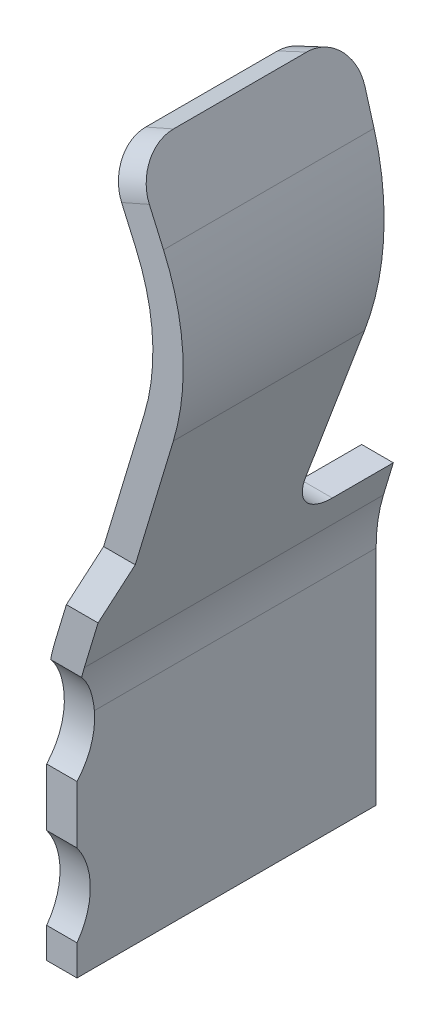
ISO-10303-21;
HEADER;
FILE_DESCRIPTION(('STEP AP214'),'2;1');
FILE_NAME('part.step','',(''),(''),'','','');
FILE_SCHEMA(('AUTOMOTIVE_DESIGN { 1 0 10303 214 1 1 1 1 }'));
ENDSEC;
DATA;
#1=APPLICATION_CONTEXT('core data for automotive mechanical design processes');
#2=APPLICATION_PROTOCOL_DEFINITION('international standard','automotive_design',2000,#1);
#3=PRODUCT_CONTEXT('',#1,'mechanical');
#4=PRODUCT('Part','Part','',(#3));
#5=PRODUCT_RELATED_PRODUCT_CATEGORY('part','',(#4));
#6=PRODUCT_DEFINITION_FORMATION('','',#4);
#7=PRODUCT_DEFINITION_CONTEXT('part definition',#1,'design');
#8=PRODUCT_DEFINITION('design','',#6,#7);
#9=PRODUCT_DEFINITION_SHAPE('','',#8);
#10=(LENGTH_UNIT() NAMED_UNIT(*) SI_UNIT(.MILLI.,.METRE.));
#11=(NAMED_UNIT(*) PLANE_ANGLE_UNIT() SI_UNIT($,.RADIAN.));
#12=(NAMED_UNIT(*) SI_UNIT($,.STERADIAN.) SOLID_ANGLE_UNIT());
#13=UNCERTAINTY_MEASURE_WITH_UNIT(LENGTH_MEASURE(1.E-05),#10,'distance_accuracy_value','');
#14=(GEOMETRIC_REPRESENTATION_CONTEXT(3) GLOBAL_UNCERTAINTY_ASSIGNED_CONTEXT((#13)) GLOBAL_UNIT_ASSIGNED_CONTEXT((#10,
#11,#12)) REPRESENTATION_CONTEXT('',''));
#15=CARTESIAN_POINT('',(0.,0.,0.));
#16=DIRECTION('',(0.,0.,1.));
#17=DIRECTION('',(1.,0.,0.));
#18=AXIS2_PLACEMENT_3D('',#15,#16,#17);
#19=CARTESIAN_POINT('',(5.76386274132999,3.53312166947706,-0.236832722369338));
#20=DIRECTION('',(-0.914255270392899,-0.402239697454472,0.0483789866630426));
#21=DIRECTION('',(0.402711251685501,-0.915327071470027,0.));
#22=AXIS2_PLACEMENT_3D('',#19,#20,#21);
#23=CYLINDRICAL_SURFACE('',#22,0.2);
#24=CARTESIAN_POINT('',(5.75035852267472,3.50329761180303,-0.434687053017797));
#25=CARTESIAN_POINT('',(5.69928159552814,3.6193909515076,-0.448650066039084));
#26=CARTESIAN_POINT('',(5.66101281648182,3.70637250294574,-0.363398989614743));
#27=CARTESIAN_POINT('',(5.66101281648182,3.70637250294574,-0.235652283248446));
#28=(BOUNDED_CURVE() B_SPLINE_CURVE(3,(#24,#25,#26,#27),.UNSPECIFIED.,.F.,
.F.) B_SPLINE_CURVE_WITH_KNOTS((4,4),(3.0320715031167,4.71238898038462),
.UNSPECIFIED.) CURVE() GEOMETRIC_REPRESENTATION_ITEM() RATIONAL_B_SPLINE_CURVE((1.,
0.778229742533871,0.778229742533871,1.)) REPRESENTATION_ITEM(''));
#29=CARTESIAN_POINT('',(5.75035852267472,3.50329761180303,-0.434687053017797));
#30=VERTEX_POINT('',#29);
#31=CARTESIAN_POINT('',(5.66101281648182,3.70637250294574,-0.235652283248446));
#32=VERTEX_POINT('',#31);
#33=EDGE_CURVE('E239',#30,#32,#28,.T.);
#34=ORIENTED_EDGE('',*,*,#33,.F.);
#35=DIRECTION('',(0.914255270392898,0.402239697454473,-0.0483789866630426));
#36=VECTOR('',#35,1.);
#37=CARTESIAN_POINT('',(-18.297177596038,-7.07676024092296,0.837819069551529));
#38=LINE('',#37,#36);
#39=CARTESIAN_POINT('',(5.61305946195422,3.44289092405021,-0.427421697659669));
#40=VERTEX_POINT('',#39);
#41=EDGE_CURVE('E11',#40,#30,#38,.T.);
#42=ORIENTED_EDGE('',*,*,#41,.F.);
#43=CARTESIAN_POINT('',(5.52371375576131,3.64596581519291,-0.228386927890318));
#44=CARTESIAN_POINT('',(5.52371375576132,3.64596581519291,-0.356133634256616));
#45=CARTESIAN_POINT('',(5.56198253480763,3.55898426375477,-0.441384710680957));
#46=CARTESIAN_POINT('',(5.61305946195422,3.44289092405021,-0.427421697659669));
#47=(BOUNDED_CURVE() B_SPLINE_CURVE(3,(#43,#44,#45,#46),.UNSPECIFIED.,.F.,
.F.) B_SPLINE_CURVE_WITH_KNOTS((4,4),(1.57079632679495,3.25111380406287),
.UNSPECIFIED.) CURVE() GEOMETRIC_REPRESENTATION_ITEM() RATIONAL_B_SPLINE_CURVE((1.,
0.778229742533869,0.778229742533869,1.)) REPRESENTATION_ITEM(''));
#48=CARTESIAN_POINT('',(5.52371375576131,3.64596581519291,-0.228386927890318));
#49=VERTEX_POINT('',#48);
#50=EDGE_CURVE('E236',#49,#40,#47,.T.);
#51=ORIENTED_EDGE('',*,*,#50,.F.);
#52=DIRECTION('',(-0.914255270392898,-0.402239697454473,0.0483789866630426));
#53=VECTOR('',#52,1.);
#54=CARTESIAN_POINT('',(5.68332049099289,3.71618708377106,-0.236832722369339));
#55=LINE('',#54,#53);
#56=EDGE_CURVE('E308',#32,#49,#55,.T.);
#57=ORIENTED_EDGE('',*,*,#56,.F.);
#58=EDGE_LOOP('',(#34,#42,#51,#57));
#59=FACE_BOUND('',#58,.T.);
#60=ADVANCED_FACE('F16',(#59),#23,.T.);
#61=CARTESIAN_POINT('',(5.74155506681892,3.52330708865174,0.423604352914838));
#62=DIRECTION('',(0.915327071470027,0.402711251685502,0.));
#63=DIRECTION('',(-0.402711251685502,0.915327071470027,0.));
#64=AXIS2_PLACEMENT_3D('',#61,#62,#63);
#65=CYLINDRICAL_SURFACE('',#64,0.2);
#66=CARTESIAN_POINT('',(5.60425600609841,3.46290040089891,0.423604352914837));
#67=DIRECTION('',(-0.915327071470027,-0.402711251685502,0.));
#68=DIRECTION('',(-0.402711251685502,0.915327071470027,0.));
#69=AXIS2_PLACEMENT_3D('',#66,#67,#68);
#70=CIRCLE('',#69,0.2);
#71=CARTESIAN_POINT('',(5.60425600609841,3.46290040089891,0.623604352914837));
#72=VERTEX_POINT('',#71);
#73=CARTESIAN_POINT('',(5.52371375576131,3.64596581519291,0.423604352914837));
#74=VERTEX_POINT('',#73);
#75=EDGE_CURVE('E259',#72,#74,#70,.T.);
#76=ORIENTED_EDGE('',*,*,#75,.F.);
#77=DIRECTION('',(-0.915327071470027,-0.402711251685503,0.));
#78=VECTOR('',#77,1.);
#79=CARTESIAN_POINT('',(-19.0130633966531,-7.36784176638169,0.623604352914803));
#80=LINE('',#79,#78);
#81=CARTESIAN_POINT('',(5.74155506681891,3.52330708865174,0.623604352914837));
#82=VERTEX_POINT('',#81);
#83=EDGE_CURVE('E27',#82,#72,#80,.T.);
#84=ORIENTED_EDGE('',*,*,#83,.F.);
#85=CARTESIAN_POINT('',(5.74155506681891,3.52330708865174,0.423604352914838));
#86=DIRECTION('',(0.915327071470027,0.402711251685502,0.));
#87=DIRECTION('',(0.402711251685502,-0.915327071470027,0.));
#88=AXIS2_PLACEMENT_3D('',#85,#86,#87);
#89=CIRCLE('',#88,0.2);
#90=CARTESIAN_POINT('',(5.66101281648181,3.70637250294574,0.423604352914837));
#91=VERTEX_POINT('',#90);
#92=EDGE_CURVE('E368',#91,#82,#89,.T.);
#93=ORIENTED_EDGE('',*,*,#92,.F.);
#94=DIRECTION('',(0.915327071470027,0.402711251685503,0.));
#95=VECTOR('',#94,1.);
#96=CARTESIAN_POINT('',(5.66101281648181,3.70637250294574,0.423604352914837));
#97=LINE('',#96,#95);
#98=EDGE_CURVE('E315',#74,#91,#97,.T.);
#99=ORIENTED_EDGE('',*,*,#98,.F.);
#100=EDGE_LOOP('',(#76,#84,#93,#99));
#101=FACE_BOUND('',#100,.T.);
#102=ADVANCED_FACE('F400',(#101),#65,.T.);
#103=CARTESIAN_POINT('',(-23.11,1.65634067151207,-0.212546111318104));
#104=DIRECTION('',(0.,-1.,0.));
#105=DIRECTION('',(0.,0.,-1.));
#106=AXIS2_PLACEMENT_3D('',#103,#104,#105);
#107=PLANE('',#106);
#108=DIRECTION('',(0.,0.,-1.));
#109=VECTOR('',#108,1.);
#110=CARTESIAN_POINT('',(5.42849659089442,1.65634067151207,-0.740000000000021));
#111=LINE('',#110,#109);
#112=CARTESIAN_POINT('',(5.42849659089442,1.65634067151207,-0.438042305987955));
#113=VERTEX_POINT('',#112);
#114=CARTESIAN_POINT('',(5.42849659089442,1.65634067151207,-0.740000000000021));
#115=VERTEX_POINT('',#114);
#116=EDGE_CURVE('E334',#113,#115,#111,.T.);
#117=ORIENTED_EDGE('',*,*,#116,.F.);
#118=DIRECTION('',(1.,0.,0.));
#119=VECTOR('',#118,1.);
#120=CARTESIAN_POINT('',(5.58516492105845,1.65634067151207,-0.438042305987954));
#121=LINE('',#120,#119);
#122=CARTESIAN_POINT('',(5.58516492105846,1.65634067151207,-0.438042305987954));
#123=VERTEX_POINT('',#122);
#124=EDGE_CURVE('E566',#113,#123,#121,.T.);
#125=ORIENTED_EDGE('',*,*,#124,.T.);
#126=DIRECTION('',(0.,0.,1.));
#127=VECTOR('',#126,1.);
#128=CARTESIAN_POINT('',(5.58516492105846,1.65634067151207,-0.74000000000002));
#129=LINE('',#128,#127);
#130=CARTESIAN_POINT('',(5.58516492105846,1.65634067151207,-0.74000000000002));
#131=VERTEX_POINT('',#130);
#132=EDGE_CURVE('E373',#131,#123,#129,.T.);
#133=ORIENTED_EDGE('',*,*,#132,.F.);
#134=DIRECTION('',(-1.,0.,0.));
#135=VECTOR('',#134,1.);
#136=CARTESIAN_POINT('',(6.35,1.65634067151207,-0.740000000000019));
#137=LINE('',#136,#135);
#138=EDGE_CURVE('E649',#131,#115,#137,.T.);
#139=ORIENTED_EDGE('',*,*,#138,.T.);
#140=EDGE_LOOP('',(#117,#125,#133,#139));
#141=FACE_BOUND('',#140,.T.);
#142=ADVANCED_FACE('F412',(#141),#107,.F.);
#143=CARTESIAN_POINT('',(-23.11,3.70637250294571,-0.459111687165995));
#144=DIRECTION('',(0.,0.119413416546905,0.992844618230162));
#145=DIRECTION('',(1.,0.,0.));
#146=AXIS2_PLACEMENT_3D('',#143,#144,#145);
#147=PLANE('',#146);
#148=DIRECTION('',(0.286748539926818,0.951150986717315,-0.11439875574724));
#149=VECTOR('',#148,1.);
#150=CARTESIAN_POINT('',(5.55412236488806,1.55337185451571,-0.200161637444148));
#151=LINE('',#150,#149);
#152=CARTESIAN_POINT('',(5.65266002273041,1.88022335482146,-0.239473382341922));
#153=VERTEX_POINT('',#152);
#154=CARTESIAN_POINT('',(5.86020176045379,2.56864369924933,-0.322272466749581));
#155=VERTEX_POINT('',#154);
#156=EDGE_CURVE('E305',#153,#155,#151,.T.);
#157=ORIENTED_EDGE('',*,*,#156,.F.);
#158=DIRECTION('',(-1.,0.,0.));
#159=VECTOR('',#158,1.);
#160=CARTESIAN_POINT('',(5.42849659089441,1.88022335482146,-0.239473382341922));
#161=LINE('',#160,#159);
#162=CARTESIAN_POINT('',(5.49599169256637,1.88022335482146,-0.239473382341922));
#163=VERTEX_POINT('',#162);
#164=EDGE_CURVE('E504',#153,#163,#161,.T.);
#165=ORIENTED_EDGE('',*,*,#164,.T.);
#166=DIRECTION('',(-0.28674853992682,-0.951150986717314,0.11439875574724));
#167=VECTOR('',#166,1.);
#168=CARTESIAN_POINT('',(5.4103360451115,1.59610175610151,-0.205300934614505));
#169=LINE('',#168,#167);
#170=CARTESIAN_POINT('',(5.71658626409634,2.61194022573825,-0.327479914176623));
#171=VERTEX_POINT('',#170);
#172=EDGE_CURVE('E172',#171,#163,#169,.T.);
#173=ORIENTED_EDGE('',*,*,#172,.F.);
#174=CARTESIAN_POINT('',(5.67447669318342,3.30329498734983,-0.410631932744419));
#175=CARTESIAN_POINT('',(5.7714549897076,3.08287189317973,-0.384120760424612));
#176=CARTESIAN_POINT('',(5.78609551117657,2.84250387207174,-0.355210731501567));
#177=CARTESIAN_POINT('',(5.71658626409634,2.61194022573825,-0.327479914176623));
#178=(BOUNDED_CURVE() B_SPLINE_CURVE(3,(#174,#175,#176,#177),.UNSPECIFIED.,.F.,
.F.) B_SPLINE_CURVE_WITH_KNOTS((4,4),(4.29791199977039,5.00519872138853),
.UNSPECIFIED.) CURVE() GEOMETRIC_REPRESENTATION_ITEM() RATIONAL_B_SPLINE_CURVE((1.,
0.958744787021091,0.958744787021091,1.)) REPRESENTATION_ITEM(''));
#179=CARTESIAN_POINT('',(5.67447669318342,3.30329498734983,-0.410631932744419));
#180=VERTEX_POINT('',#179);
#181=EDGE_CURVE('E245',#180,#171,#178,.T.);
#182=ORIENTED_EDGE('',*,*,#181,.F.);
#183=DIRECTION('',(0.400292818236851,-0.909830186054405,0.109428936813833));
#184=VECTOR('',#183,1.);
#185=CARTESIAN_POINT('',(5.66004918034407,3.33608744850051,-0.414576013974334));
#186=LINE('',#185,#184);
#187=EDGE_CURVE('E242',#40,#180,#186,.T.);
#188=ORIENTED_EDGE('',*,*,#187,.F.);
#189=ORIENTED_EDGE('',*,*,#41,.T.);
#190=DIRECTION('',(-0.40029281823685,0.909830186054405,-0.109428936813833));
#191=VECTOR('',#190,1.);
#192=CARTESIAN_POINT('',(5.79766648991178,3.39577078475993,-0.421754368938235));
#193=LINE('',#192,#191);
#194=CARTESIAN_POINT('',(5.81177575390392,3.36370167510267,-0.417897288102547));
#195=VERTEX_POINT('',#194);
#196=EDGE_CURVE('E296',#195,#30,#193,.T.);
#197=ORIENTED_EDGE('',*,*,#196,.F.);
#198=CARTESIAN_POINT('',(5.86020176045379,2.56864369924933,-0.322272466749581));
#199=CARTESIAN_POINT('',(5.94013739459604,2.83379189253285,-0.354162906673267));
#200=CARTESIAN_POINT('',(5.92330079490673,3.11021511680704,-0.387409439934769));
#201=CARTESIAN_POINT('',(5.81177575390392,3.36370167510267,-0.417897288102547));
#202=(BOUNDED_CURVE() B_SPLINE_CURVE(3,(#198,#199,#200,#201),.UNSPECIFIED.,.F.,
.F.) B_SPLINE_CURVE_WITH_KNOTS((4,4),(1.27798658579106,1.98527330740919),
.UNSPECIFIED.) CURVE() GEOMETRIC_REPRESENTATION_ITEM() RATIONAL_B_SPLINE_CURVE((1.,
0.958744787021091,0.958744787021091,1.)) REPRESENTATION_ITEM(''));
#203=EDGE_CURVE('E360',#155,#195,#202,.T.);
#204=ORIENTED_EDGE('',*,*,#203,.F.);
#205=EDGE_LOOP('',(#157,#165,#173,#182,#188,#189,#197,#204));
#206=FACE_BOUND('',#205,.T.);
#207=ADVANCED_FACE('F243',(#206),#147,.F.);
#208=CARTESIAN_POINT('',(-23.11,1.94413292378283,0.623604352914797));
#209=DIRECTION('',(0.,0.,-1.));
#210=DIRECTION('',(0.,-1.,0.));
#211=AXIS2_PLACEMENT_3D('',#208,#209,#210);
#212=PLANE('',#211);
#213=DIRECTION('',(0.4027112516855,-0.915327071470028,0.));
#214=VECTOR('',#213,1.);
#215=CARTESIAN_POINT('',(5.81177575390392,3.36370167510267,0.623604352914838));
#216=LINE('',#215,#214);
#217=CARTESIAN_POINT('',(5.81177575390392,3.36370167510267,0.623604352914838));
#218=VERTEX_POINT('',#217);
#219=EDGE_CURVE('E363',#82,#218,#216,.T.);
#220=ORIENTED_EDGE('',*,*,#219,.F.);
#221=ORIENTED_EDGE('',*,*,#83,.T.);
#222=DIRECTION('',(-0.402711251685501,0.915327071470028,0.));
#223=VECTOR('',#222,1.);
#224=CARTESIAN_POINT('',(5.67447669318342,3.30329498734984,0.623604352914837));
#225=LINE('',#224,#223);
#226=CARTESIAN_POINT('',(5.67447669318341,3.30329498734983,0.623604352914837));
#227=VERTEX_POINT('',#226);
#228=EDGE_CURVE('E266',#227,#72,#225,.T.);
#229=ORIENTED_EDGE('',*,*,#228,.F.);
#230=CARTESIAN_POINT('',(4.75914962171339,2.90058373566433,0.623604352914836));
#231=DIRECTION('',(0.,0.,1.));
#232=DIRECTION('',(-1.,0.,0.));
#233=AXIS2_PLACEMENT_3D('',#230,#231,#232);
#234=CIRCLE('',#233,1.);
#235=CARTESIAN_POINT('',(5.71658626409634,2.61194022573825,0.623604352914837));
#236=VERTEX_POINT('',#235);
#237=EDGE_CURVE('E330',#236,#227,#234,.T.);
#238=ORIENTED_EDGE('',*,*,#237,.F.);
#239=DIRECTION('',(0.28864350992609,0.957436642382956,0.));
#240=VECTOR('',#239,1.);
#241=CARTESIAN_POINT('',(5.39256335761704,1.53714937485737,0.623604352914836));
#242=LINE('',#241,#240);
#243=CARTESIAN_POINT('',(5.51525884977164,1.94413292378283,0.623604352914837));
#244=VERTEX_POINT('',#243);
#245=EDGE_CURVE('E184',#244,#236,#242,.T.);
#246=ORIENTED_EDGE('',*,*,#245,.F.);
#247=DIRECTION('',(1.,0.,0.));
#248=VECTOR('',#247,1.);
#249=CARTESIAN_POINT('',(-23.11,1.94413292378283,0.623604352914797));
#250=LINE('',#249,#248);
#251=CARTESIAN_POINT('',(5.67192717993567,1.94413292378283,0.623604352914837));
#252=VERTEX_POINT('',#251);
#253=EDGE_CURVE('E684',#244,#252,#250,.T.);
#254=ORIENTED_EDGE('',*,*,#253,.T.);
#255=DIRECTION('',(-0.288643509926088,-0.957436642382956,0.));
#256=VECTOR('',#255,1.);
#257=CARTESIAN_POINT('',(5.53617885397449,1.49385284836845,0.623604352914837));
#258=LINE('',#257,#256);
#259=CARTESIAN_POINT('',(5.86020176045378,2.56864369924933,0.623604352914837));
#260=VERTEX_POINT('',#259);
#261=EDGE_CURVE('E304',#260,#252,#258,.T.);
#262=ORIENTED_EDGE('',*,*,#261,.F.);
#263=CARTESIAN_POINT('',(4.75914962171339,2.90058373566433,0.623604352914836));
#264=DIRECTION('',(0.,0.,-1.));
#265=DIRECTION('',(-1.,0.,0.));
#266=AXIS2_PLACEMENT_3D('',#263,#264,#265);
#267=CIRCLE('',#266,1.15);
#268=EDGE_CURVE('E369',#218,#260,#267,.T.);
#269=ORIENTED_EDGE('',*,*,#268,.F.);
#270=EDGE_LOOP('',(#220,#221,#229,#238,#246,#254,#262,#269));
#271=FACE_BOUND('',#270,.T.);
#272=ADVANCED_FACE('F486',(#271),#212,.F.);
#273=CARTESIAN_POINT('',(-23.11,1.7003498353216,0.749999999999972));
#274=DIRECTION('',(0.,-0.460287319631494,-0.887770005906065));
#275=DIRECTION('',(0.,-0.887770005906065,0.460287319631494));
#276=AXIS2_PLACEMENT_3D('',#273,#274,#275);
#277=PLANE('',#276);
#278=ORIENTED_EDGE('',*,*,#253,.F.);
#279=DIRECTION('',(0.258541028225373,0.857586072334425,-0.444637678635293));
#280=VECTOR('',#279,1.);
#281=CARTESIAN_POINT('',(5.57357656169357,2.13757401070795,0.523309818502746));
#282=LINE('',#281,#280);
#283=CARTESIAN_POINT('',(5.44757891232074,1.7196371362757,0.73999999999998));
#284=VERTEX_POINT('',#283);
#285=EDGE_CURVE('E326',#284,#244,#282,.T.);
#286=ORIENTED_EDGE('',*,*,#285,.F.);
#287=DIRECTION('',(-1.,0.,0.));
#288=VECTOR('',#287,1.);
#289=CARTESIAN_POINT('',(6.35,1.7196371362757,0.739999999999981));
#290=LINE('',#289,#288);
#291=CARTESIAN_POINT('',(5.60424724248478,1.7196371362757,0.73999999999998));
#292=VERTEX_POINT('',#291);
#293=EDGE_CURVE('E356',#292,#284,#290,.T.);
#294=ORIENTED_EDGE('',*,*,#293,.F.);
#295=DIRECTION('',(-0.258541028225372,-0.857586072334425,0.444637678635293));
#296=VECTOR('',#295,1.);
#297=CARTESIAN_POINT('',(5.7197726380838,2.10283732290249,0.541319952677682));
#298=LINE('',#297,#296);
#299=EDGE_CURVE('E357',#252,#292,#298,.T.);
#300=ORIENTED_EDGE('',*,*,#299,.F.);
#301=EDGE_LOOP('',(#278,#286,#294,#300));
#302=FACE_BOUND('',#301,.T.);
#303=ADVANCED_FACE('F484',(#302),#277,.F.);
#304=CARTESIAN_POINT('',(6.35,1.24850586493128,0.739999999999981));
#305=DIRECTION('',(0.,0.,-1.));
#306=DIRECTION('',(0.,-1.,0.));
#307=AXIS2_PLACEMENT_3D('',#304,#305,#306);
#308=PLANE('',#307);
#309=DIRECTION('',(0.,1.,0.));
#310=VECTOR('',#309,1.);
#311=CARTESIAN_POINT('',(5.5,0.145965815192914,0.73999999999998));
#312=LINE('',#311,#310);
#313=CARTESIAN_POINT('',(5.5,0.145965815192914,0.73999999999998));
#314=VERTEX_POINT('',#313);
#315=CARTESIAN_POINT('',(5.5,0.296740599868486,0.73999999999998));
#316=VERTEX_POINT('',#315);
#317=EDGE_CURVE('E321',#314,#316,#312,.T.);
#318=ORIENTED_EDGE('',*,*,#317,.T.);
#319=DIRECTION('',(-1.,0.,0.));
#320=VECTOR('',#319,1.);
#321=CARTESIAN_POINT('',(-23.11,0.296740599868486,0.73999999999994));
#322=LINE('',#321,#320);
#323=CARTESIAN_POINT('',(5.35,0.296740599868486,0.739999999999979));
#324=VERTEX_POINT('',#323);
#325=EDGE_CURVE('E349',#316,#324,#322,.T.);
#326=ORIENTED_EDGE('',*,*,#325,.T.);
#327=DIRECTION('',(0.,-1.,0.));
#328=VECTOR('',#327,1.);
#329=CARTESIAN_POINT('',(5.35,0.145965815192914,0.739999999999979));
#330=LINE('',#329,#328);
#331=CARTESIAN_POINT('',(5.35,0.145965815192914,0.739999999999979));
#332=VERTEX_POINT('',#331);
#333=EDGE_CURVE('E646',#324,#332,#330,.T.);
#334=ORIENTED_EDGE('',*,*,#333,.T.);
#335=DIRECTION('',(1.,0.,0.));
#336=VECTOR('',#335,1.);
#337=CARTESIAN_POINT('',(5.5,0.145965815192914,0.73999999999998));
#338=LINE('',#337,#336);
#339=EDGE_CURVE('E278',#332,#314,#338,.T.);
#340=ORIENTED_EDGE('',*,*,#339,.T.);
#341=EDGE_LOOP('',(#318,#326,#334,#340));
#342=FACE_BOUND('',#341,.T.);
#343=ADVANCED_FACE('F18',(#342),#308,.F.);
#344=CARTESIAN_POINT('',(6.35,1.24850586493128,-0.740000000000019));
#345=DIRECTION('',(0.,0.,-1.));
#346=DIRECTION('',(0.,-1.,0.));
#347=AXIS2_PLACEMENT_3D('',#344,#345,#346);
#348=PLANE('',#347);
#349=ORIENTED_EDGE('',*,*,#138,.F.);
#350=DIRECTION('',(0.288643509926088,0.957436642382956,0.));
#351=VECTOR('',#350,1.);
#352=CARTESIAN_POINT('',(5.53617885397449,1.49385284836845,-0.74000000000002));
#353=LINE('',#352,#351);
#354=CARTESIAN_POINT('',(5.53617885397449,1.49385284836845,-0.74000000000002));
#355=VERTEX_POINT('',#354);
#356=EDGE_CURVE('E325',#355,#131,#353,.T.);
#357=ORIENTED_EDGE('',*,*,#356,.F.);
#358=CARTESIAN_POINT('',(6.35,1.24850586493128,-0.740000000000019));
#359=DIRECTION('',(0.,0.,-1.));
#360=DIRECTION('',(1.,0.,0.));
#361=AXIS2_PLACEMENT_3D('',#358,#359,#360);
#362=CIRCLE('',#361,0.85);
#363=CARTESIAN_POINT('',(5.5,1.24850586493128,-0.74000000000002));
#364=VERTEX_POINT('',#363);
#365=EDGE_CURVE('E320',#364,#355,#362,.T.);
#366=ORIENTED_EDGE('',*,*,#365,.F.);
#367=DIRECTION('',(0.,1.,0.));
#368=VECTOR('',#367,1.);
#369=CARTESIAN_POINT('',(5.5,0.145965815192914,-0.74000000000002));
#370=LINE('',#369,#368);
#371=CARTESIAN_POINT('',(5.5,0.145965815192914,-0.74000000000002));
#372=VERTEX_POINT('',#371);
#373=EDGE_CURVE('E316',#372,#364,#370,.T.);
#374=ORIENTED_EDGE('',*,*,#373,.F.);
#375=DIRECTION('',(1.,0.,0.));
#376=VECTOR('',#375,1.);
#377=CARTESIAN_POINT('',(5.5,0.145965815192914,-0.74000000000002));
#378=LINE('',#377,#376);
#379=CARTESIAN_POINT('',(5.35,0.145965815192914,-0.740000000000021));
#380=VERTEX_POINT('',#379);
#381=EDGE_CURVE('E285',#380,#372,#378,.T.);
#382=ORIENTED_EDGE('',*,*,#381,.F.);
#383=DIRECTION('',(0.,-1.,0.));
#384=VECTOR('',#383,1.);
#385=CARTESIAN_POINT('',(5.35,0.145965815192914,-0.740000000000021));
#386=LINE('',#385,#384);
#387=CARTESIAN_POINT('',(5.35,1.24850586493128,-0.740000000000021));
#388=VERTEX_POINT('',#387);
#389=EDGE_CURVE('E42',#388,#380,#386,.T.);
#390=ORIENTED_EDGE('',*,*,#389,.F.);
#391=CARTESIAN_POINT('',(6.35,1.24850586493128,-0.740000000000019));
#392=DIRECTION('',(0.,0.,1.));
#393=DIRECTION('',(1.,0.,0.));
#394=AXIS2_PLACEMENT_3D('',#391,#392,#393);
#395=CIRCLE('',#394,1.);
#396=CARTESIAN_POINT('',(5.39256335761705,1.53714937485737,-0.740000000000021));
#397=VERTEX_POINT('',#396);
#398=EDGE_CURVE('E309',#397,#388,#395,.T.);
#399=ORIENTED_EDGE('',*,*,#398,.F.);
#400=DIRECTION('',(-0.28864350992609,-0.957436642382956,0.));
#401=VECTOR('',#400,1.);
#402=CARTESIAN_POINT('',(5.39256335761705,1.53714937485737,-0.740000000000021));
#403=LINE('',#402,#401);
#404=EDGE_CURVE('E338',#115,#397,#403,.T.);
#405=ORIENTED_EDGE('',*,*,#404,.F.);
#406=EDGE_LOOP('',(#349,#357,#366,#374,#382,#390,#399,#405));
#407=FACE_BOUND('',#406,.T.);
#408=ADVANCED_FACE('F437',(#407),#348,.T.);
#409=CARTESIAN_POINT('',(5.35,0.145965815192914,-0.740000000000021));
#410=DIRECTION('',(1.,0.,0.));
#411=DIRECTION('',(0.,1.,0.));
#412=AXIS2_PLACEMENT_3D('',#409,#410,#411);
#413=PLANE('',#412);
#414=DIRECTION('',(0.,-1.,0.));
#415=VECTOR('',#414,1.);
#416=CARTESIAN_POINT('',(5.35,0.145965815192914,0.739999999999979));
#417=LINE('',#416,#415);
#418=CARTESIAN_POINT('',(5.35,0.988055123608201,0.739999999999979));
#419=VERTEX_POINT('',#418);
#420=CARTESIAN_POINT('',(5.35,0.703259400131467,0.739999999999979));
#421=VERTEX_POINT('',#420);
#422=EDGE_CURVE('E273',#419,#421,#417,.T.);
#423=ORIENTED_EDGE('',*,*,#422,.F.);
#424=CARTESIAN_POINT('',(5.35,1.21669179396546,0.995153761033096));
#425=DIRECTION('',(1.,0.,0.));
#426=DIRECTION('',(0.,1.,0.));
#427=AXIS2_PLACEMENT_3D('',#424,#425,#426);
#428=CIRCLE('',#427,0.342604974863759);
#429=CARTESIAN_POINT('',(5.35,1.24850586493128,0.654029100989324));
#430=VERTEX_POINT('',#429);
#431=EDGE_CURVE('E344',#419,#430,#428,.T.);
#432=ORIENTED_EDGE('',*,*,#431,.T.);
#433=DIRECTION('',(0.,0.,1.));
#434=VECTOR('',#433,1.);
#435=CARTESIAN_POINT('',(5.35,1.24850586493128,-0.740000000000021));
#436=LINE('',#435,#434);
#437=EDGE_CURVE('E312',#388,#430,#436,.T.);
#438=ORIENTED_EDGE('',*,*,#437,.F.);
#439=ORIENTED_EDGE('',*,*,#389,.T.);
#440=DIRECTION('',(0.,0.,1.));
#441=VECTOR('',#440,1.);
#442=CARTESIAN_POINT('',(5.35,0.145965815192914,-0.740000000000021));
#443=LINE('',#442,#441);
#444=EDGE_CURVE('E589',#380,#332,#443,.T.);
#445=ORIENTED_EDGE('',*,*,#444,.T.);
#446=ORIENTED_EDGE('',*,*,#333,.F.);
#447=CARTESIAN_POINT('',(5.35,0.499999999999977,1.0194268345702));
#448=DIRECTION('',(1.,0.,0.));
#449=DIRECTION('',(0.,1.,0.));
#450=AXIS2_PLACEMENT_3D('',#447,#448,#449);
#451=CIRCLE('',#450,0.345533991988848);
#452=EDGE_CURVE('E345',#324,#421,#451,.T.);
#453=ORIENTED_EDGE('',*,*,#452,.T.);
#454=EDGE_LOOP('',(#423,#432,#438,#439,#445,#446,#453));
#455=FACE_BOUND('',#454,.T.);
#456=ADVANCED_FACE('F399',(#455),#413,.F.);
#457=CARTESIAN_POINT('',(6.35,1.24850586493128,-0.740000000000019));
#458=DIRECTION('',(0.,0.,1.));
#459=DIRECTION('',(-1.,0.,0.));
#460=AXIS2_PLACEMENT_3D('',#457,#458,#459);
#461=CYLINDRICAL_SURFACE('',#460,1.);
#462=ORIENTED_EDGE('',*,*,#437,.T.);
#463=CARTESIAN_POINT('',(5.35,1.24850586493127,0.654029100989324));
#464=CARTESIAN_POINT('',(5.34999992592637,1.25306932177748,0.654454497923835));
#465=CARTESIAN_POINT('',(5.35003123527863,1.25762446546712,0.654969794425774));
#466=CARTESIAN_POINT('',(5.35015516509568,1.26669234380872,0.656178662703507));
#467=CARTESIAN_POINT('',(5.35024754920297,1.27120517419842,0.656871540938563));
#468=CARTESIAN_POINT('',(5.35049191329322,1.28018764830056,0.658435530000101));
#469=CARTESIAN_POINT('',(5.35064375710387,1.28465736694881,0.659306231418194));
#470=CARTESIAN_POINT('',(5.35100522296896,1.29355289226453,0.661225514697385));
#471=CARTESIAN_POINT('',(5.3512148055409,1.29797872680563,0.66227397481712));
#472=CARTESIAN_POINT('',(5.35168997207293,1.30678583476397,0.664548502475786));
#473=CARTESIAN_POINT('',(5.35195560747397,1.31116706334694,0.665774732832754));
#474=CARTESIAN_POINT('',(5.35254110847118,1.31988437499395,0.668404514864849));
#475=CARTESIAN_POINT('',(5.35286110900543,1.32422031651338,0.669808505488944));
#476=CARTESIAN_POINT('',(5.35355358930377,1.33284654509273,0.672793524574298));
#477=CARTESIAN_POINT('',(5.35392627862693,1.33713657245114,0.67437525453736));
#478=CARTESIAN_POINT('',(5.35472239758146,1.34567049059148,0.677715533217567));
#479=CARTESIAN_POINT('',(5.35514610132699,1.34991398511754,0.679475028174295));
#480=CARTESIAN_POINT('',(5.35603678150611,1.35830019523904,0.683146652073494));
#481=CARTESIAN_POINT('',(5.35650349280442,1.36244335249443,0.685057836907499));
#482=CARTESIAN_POINT('',(5.35747687139799,1.37063194178074,0.6890335315101));
#483=CARTESIAN_POINT('',(5.35798338788338,1.3746776733665,0.691097460992356));
#484=CARTESIAN_POINT('',(5.35903286831764,1.38267128376232,0.695378434355305));
#485=CARTESIAN_POINT('',(5.35957575264737,1.3866193519919,0.69759514404689));
#486=CARTESIAN_POINT('',(5.36069455701777,1.39441764648526,0.702181418874191));
#487=CARTESIAN_POINT('',(5.36127045700561,1.39826793013232,0.704550891332612));
#488=CARTESIAN_POINT('',(5.36245197037195,1.40587073759695,0.709442454924467));
#489=CARTESIAN_POINT('',(5.36305761081716,1.40962316741917,0.711964685588729));
#490=CARTESIAN_POINT('',(5.36429537926365,1.4170304504751,0.717161525963165));
#491=CARTESIAN_POINT('',(5.36492756852699,1.42068504210779,0.719836493879691));
#492=CARTESIAN_POINT('',(5.36621529345779,1.42789683764576,0.725338623347788));
#493=CARTESIAN_POINT('',(5.36687091152925,1.43145359950846,0.728166344681211));
#494=CARTESIAN_POINT('',(5.36820248405423,1.43847023752972,0.733973670299352));
#495=CARTESIAN_POINT('',(5.36887852949904,1.44192948379825,0.736954014976151));
#496=CARTESIAN_POINT('',(5.36956088186527,1.44532846432271,0.73999999999998));
#497=B_SPLINE_CURVE_WITH_KNOTS('',3,(#463,#464,#465,#466,#467,#468,#469,#470,#471,#472,#473,
#474,#475,#476,#477,#478,#479,#480,#481,#482,#483,#484,#485,#486,#487,#488,#489,#490,#491,#492,
#493,#494,#495,#496),.UNSPECIFIED.,.F.,.F.,(4,2,2,2,2,2,2,2,2,2,2,2,2,2,2,2,4),(0.,
0.013748827736232,0.0274447569667543,0.0411095020469267,0.0547649260984996,0.0684329369744623,
0.0821353821572885,0.0958939450956067,0.109730045405059,0.123485924962941,0.137191991355335,
0.150868974599205,0.164537737053089,0.17821917870054,0.191934141578145,0.205703315519925,
0.219547147320743),.UNSPECIFIED.);
#498=CARTESIAN_POINT('',(5.36956088186527,1.44532846432271,0.739999999999979));
#499=VERTEX_POINT('',#498);
#500=EDGE_CURVE('E350',#430,#499,#497,.T.);
#501=ORIENTED_EDGE('',*,*,#500,.T.);
#502=CARTESIAN_POINT('',(6.35,1.24850586493128,0.739999999999981));
#503=DIRECTION('',(0.,0.,1.));
#504=DIRECTION('',(1.,0.,0.));
#505=AXIS2_PLACEMENT_3D('',#502,#503,#504);
#506=CIRCLE('',#505,1.);
#507=CARTESIAN_POINT('',(5.39256335761705,1.53714937485737,0.739999999999979));
#508=VERTEX_POINT('',#507);
#509=EDGE_CURVE('E355',#508,#499,#506,.T.);
#510=ORIENTED_EDGE('',*,*,#509,.F.);
#511=DIRECTION('',(0.,0.,1.));
#512=VECTOR('',#511,1.);
#513=CARTESIAN_POINT('',(5.39256335761705,1.53714937485737,-0.740000000000021));
#514=LINE('',#513,#512);
#515=EDGE_CURVE('E329',#397,#508,#514,.T.);
#516=ORIENTED_EDGE('',*,*,#515,.F.);
#517=ORIENTED_EDGE('',*,*,#398,.T.);
#518=EDGE_LOOP('',(#462,#501,#510,#516,#517));
#519=FACE_BOUND('',#518,.T.);
#520=ADVANCED_FACE('F388',(#519),#461,.T.);
#521=CARTESIAN_POINT('',(5.39256335761705,1.53714937485737,-0.740000000000021));
#522=DIRECTION('',(0.957436642382956,-0.28864350992609,0.));
#523=DIRECTION('',(0.,0.,-1.));
#524=AXIS2_PLACEMENT_3D('',#521,#522,#523);
#525=PLANE('',#524);
#526=ORIENTED_EDGE('',*,*,#172,.T.);
#527=CARTESIAN_POINT('',(5.49599169256637,1.88022335482146,-0.239473382341922));
#528=CARTESIAN_POINT('',(5.49360172570135,1.87229578405696,-0.238519901512672));
#529=CARTESIAN_POINT('',(5.49119884441548,1.86432537588468,-0.238042305987954));
#530=CARTESIAN_POINT('',(5.48879165317817,1.85634067151208,-0.238042305987954));
#531=(BOUNDED_CURVE() B_SPLINE_CURVE(3,(#527,#528,#529,#530),.UNSPECIFIED.,.F.,
.F.) B_SPLINE_CURVE_WITH_KNOTS((4,4),(4.59268992994791,4.71238898038469),
.UNSPECIFIED.) CURVE() GEOMETRIC_REPRESENTATION_ITEM() RATIONAL_B_SPLINE_CURVE((1.,
0.998806367803328,0.998806367803328,1.)) REPRESENTATION_ITEM(''));
#532=CARTESIAN_POINT('',(5.48879165317817,1.85634067151208,-0.238042305987954));
#533=VERTEX_POINT('',#532);
#534=EDGE_CURVE('E558',#163,#533,#531,.T.);
#535=ORIENTED_EDGE('',*,*,#534,.T.);
#536=CARTESIAN_POINT('',(5.48879165317817,1.85634067151208,-0.238042305987954));
#537=CARTESIAN_POINT('',(5.45347162343648,1.73918338398669,-0.238042305987954));
#538=CARTESIAN_POINT('',(5.42849659089442,1.65634067151208,-0.320885018462573));
#539=CARTESIAN_POINT('',(5.42849659089442,1.65634067151207,-0.438042305987955));
#540=(BOUNDED_CURVE() B_SPLINE_CURVE(3,(#536,#537,#538,#539),.UNSPECIFIED.,.F.,
.F.) B_SPLINE_CURVE_WITH_KNOTS((4,4),(4.71238898038469,6.28318530717959),
.UNSPECIFIED.) CURVE() GEOMETRIC_REPRESENTATION_ITEM() RATIONAL_B_SPLINE_CURVE((1.,
0.804737854124365,0.804737854124365,1.)) REPRESENTATION_ITEM(''));
#541=EDGE_CURVE('E562',#533,#113,#540,.T.);
#542=ORIENTED_EDGE('',*,*,#541,.T.);
#543=ORIENTED_EDGE('',*,*,#116,.T.);
#544=ORIENTED_EDGE('',*,*,#404,.T.);
#545=ORIENTED_EDGE('',*,*,#515,.T.);
#546=DIRECTION('',(-0.28864350992609,-0.957436642382956,0.));
#547=VECTOR('',#546,1.);
#548=CARTESIAN_POINT('',(5.39256335761704,1.53714937485737,0.739999999999979));
#549=LINE('',#548,#547);
#550=EDGE_CURVE('E351',#284,#508,#549,.T.);
#551=ORIENTED_EDGE('',*,*,#550,.F.);
#552=ORIENTED_EDGE('',*,*,#285,.T.);
#553=ORIENTED_EDGE('',*,*,#245,.T.);
#554=DIRECTION('',(0.,0.,1.));
#555=VECTOR('',#554,1.);
#556=CARTESIAN_POINT('',(5.71658626409634,2.61194022573825,-0.74000000000002));
#557=LINE('',#556,#555);
#558=EDGE_CURVE('E333',#171,#236,#557,.T.);
#559=ORIENTED_EDGE('',*,*,#558,.F.);
#560=EDGE_LOOP('',(#526,#535,#542,#543,#544,#545,#551,#552,#553,#559));
#561=FACE_BOUND('',#560,.T.);
#562=ADVANCED_FACE('F398',(#561),#525,.F.);
#563=CARTESIAN_POINT('',(4.75914962171339,2.90058373566433,-0.740000000000021));
#564=DIRECTION('',(0.,0.,1.));
#565=DIRECTION('',(-1.,0.,0.));
#566=AXIS2_PLACEMENT_3D('',#563,#564,#565);
#567=CYLINDRICAL_SURFACE('',#566,1.);
#568=DIRECTION('',(0.,0.,1.));
#569=VECTOR('',#568,1.);
#570=CARTESIAN_POINT('',(5.67447669318342,3.30329498734983,-0.74000000000002));
#571=LINE('',#570,#569);
#572=EDGE_CURVE('E250',#180,#227,#571,.T.);
#573=ORIENTED_EDGE('',*,*,#572,.F.);
#574=ORIENTED_EDGE('',*,*,#181,.T.);
#575=ORIENTED_EDGE('',*,*,#558,.T.);
#576=ORIENTED_EDGE('',*,*,#237,.T.);
#577=EDGE_LOOP('',(#573,#574,#575,#576));
#578=FACE_BOUND('',#577,.T.);
#579=ADVANCED_FACE('F411',(#578),#567,.F.);
#580=CARTESIAN_POINT('',(5.67447669318342,3.30329498734984,-0.74000000000002));
#581=DIRECTION('',(0.915327071470028,0.402711251685501,0.));
#582=DIRECTION('',(0.,0.,-1.));
#583=AXIS2_PLACEMENT_3D('',#580,#581,#582);
#584=PLANE('',#583);
#585=ORIENTED_EDGE('',*,*,#228,.T.);
#586=ORIENTED_EDGE('',*,*,#75,.T.);
#587=DIRECTION('',(0.,0.,1.));
#588=VECTOR('',#587,1.);
#589=CARTESIAN_POINT('',(5.52371375576131,3.64596581519291,-0.740000000000021));
#590=LINE('',#589,#588);
#591=EDGE_CURVE('E257',#49,#74,#590,.T.);
#592=ORIENTED_EDGE('',*,*,#591,.F.);
#593=ORIENTED_EDGE('',*,*,#50,.T.);
#594=ORIENTED_EDGE('',*,*,#187,.T.);
#595=ORIENTED_EDGE('',*,*,#572,.T.);
#596=EDGE_LOOP('',(#585,#586,#592,#593,#594,#595));
#597=FACE_BOUND('',#596,.T.);
#598=ADVANCED_FACE('F254',(#597),#584,.F.);
#599=CARTESIAN_POINT('',(5.66101281648182,3.70637250294574,-0.74000000000002));
#600=DIRECTION('',(0.402711251685503,-0.915327071470027,0.));
#601=DIRECTION('',(0.,0.,-1.));
#602=AXIS2_PLACEMENT_3D('',#599,#600,#601);
#603=PLANE('',#602);
#604=ORIENTED_EDGE('',*,*,#591,.T.);
#605=ORIENTED_EDGE('',*,*,#98,.T.);
#606=DIRECTION('',(0.,0.,1.));
#607=VECTOR('',#606,1.);
#608=CARTESIAN_POINT('',(5.66101281648182,3.70637250294574,-0.74000000000002));
#609=LINE('',#608,#607);
#610=EDGE_CURVE('E364',#32,#91,#609,.T.);
#611=ORIENTED_EDGE('',*,*,#610,.F.);
#612=ORIENTED_EDGE('',*,*,#56,.T.);
#613=EDGE_LOOP('',(#604,#605,#611,#612));
#614=FACE_BOUND('',#613,.T.);
#615=ADVANCED_FACE('F404',(#614),#603,.F.);
#616=CARTESIAN_POINT('',(5.81177575390392,3.36370167510267,-0.74000000000002));
#617=DIRECTION('',(-0.915327071470028,-0.4027112516855,0.));
#618=DIRECTION('',(-0.4027112516855,0.915327071470028,0.));
#619=AXIS2_PLACEMENT_3D('',#616,#617,#618);
#620=PLANE('',#619);
#621=ORIENTED_EDGE('',*,*,#610,.T.);
#622=ORIENTED_EDGE('',*,*,#92,.T.);
#623=ORIENTED_EDGE('',*,*,#219,.T.);
#624=DIRECTION('',(0.,0.,1.));
#625=VECTOR('',#624,1.);
#626=CARTESIAN_POINT('',(5.81177575390392,3.36370167510267,-0.74000000000002));
#627=LINE('',#626,#625);
#628=EDGE_CURVE('E608',#195,#218,#627,.T.);
#629=ORIENTED_EDGE('',*,*,#628,.F.);
#630=ORIENTED_EDGE('',*,*,#196,.T.);
#631=ORIENTED_EDGE('',*,*,#33,.T.);
#632=EDGE_LOOP('',(#621,#622,#623,#629,#630,#631));
#633=FACE_BOUND('',#632,.T.);
#634=ADVANCED_FACE('F407',(#633),#620,.F.);
#635=CARTESIAN_POINT('',(4.75914962171339,2.90058373566433,-0.740000000000021));
#636=DIRECTION('',(0.,0.,1.));
#637=DIRECTION('',(-1.,0.,0.));
#638=AXIS2_PLACEMENT_3D('',#635,#636,#637);
#639=CYLINDRICAL_SURFACE('',#638,1.15);
#640=DIRECTION('',(0.,0.,1.));
#641=VECTOR('',#640,1.);
#642=CARTESIAN_POINT('',(5.86020176045379,2.56864369924933,-0.74000000000002));
#643=LINE('',#642,#641);
#644=EDGE_CURVE('E297',#155,#260,#643,.T.);
#645=ORIENTED_EDGE('',*,*,#644,.F.);
#646=ORIENTED_EDGE('',*,*,#203,.T.);
#647=ORIENTED_EDGE('',*,*,#628,.T.);
#648=ORIENTED_EDGE('',*,*,#268,.T.);
#649=EDGE_LOOP('',(#645,#646,#647,#648));
#650=FACE_BOUND('',#649,.T.);
#651=ADVANCED_FACE('F424',(#650),#639,.T.);
#652=CARTESIAN_POINT('',(5.53617885397449,1.49385284836845,-0.74000000000002));
#653=DIRECTION('',(-0.957436642382956,0.288643509926088,0.));
#654=DIRECTION('',(0.,0.,1.));
#655=AXIS2_PLACEMENT_3D('',#652,#653,#654);
#656=PLANE('',#655);
#657=ORIENTED_EDGE('',*,*,#356,.T.);
#658=ORIENTED_EDGE('',*,*,#132,.T.);
#659=CARTESIAN_POINT('',(5.58516492105846,1.65634067151207,-0.438042305987954));
#660=CARTESIAN_POINT('',(5.58516492105846,1.65634067151208,-0.320885018462573));
#661=CARTESIAN_POINT('',(5.61013995360051,1.73918338398669,-0.238042305987954));
#662=CARTESIAN_POINT('',(5.6454599833422,1.85634067151208,-0.238042305987954));
#663=(BOUNDED_CURVE() B_SPLINE_CURVE(3,(#659,#660,#661,#662),.UNSPECIFIED.,.F.,
.F.) B_SPLINE_CURVE_WITH_KNOTS((4,4),(0.,1.5707963267949),
.UNSPECIFIED.) CURVE() GEOMETRIC_REPRESENTATION_ITEM() RATIONAL_B_SPLINE_CURVE((1.,
0.804737854124365,0.804737854124365,1.)) REPRESENTATION_ITEM(''));
#664=CARTESIAN_POINT('',(5.6454599833422,1.85634067151208,-0.238042305987954));
#665=VERTEX_POINT('',#664);
#666=EDGE_CURVE('E655',#123,#665,#663,.T.);
#667=ORIENTED_EDGE('',*,*,#666,.T.);
#668=CARTESIAN_POINT('',(5.6454599833422,1.85634067151208,-0.238042305987954));
#669=CARTESIAN_POINT('',(5.64786717457952,1.86432537588468,-0.238042305987954));
#670=CARTESIAN_POINT('',(5.65027005586539,1.87229578405696,-0.238519901512672));
#671=CARTESIAN_POINT('',(5.65266002273041,1.88022335482146,-0.239473382341922));
#672=(BOUNDED_CURVE() B_SPLINE_CURVE(3,(#668,#669,#670,#671),.UNSPECIFIED.,.F.,
.F.) B_SPLINE_CURVE_WITH_KNOTS((4,4),(1.5707963267949,1.69049537723168),
.UNSPECIFIED.) CURVE() GEOMETRIC_REPRESENTATION_ITEM() RATIONAL_B_SPLINE_CURVE((1.,
0.998806367803328,0.998806367803328,1.)) REPRESENTATION_ITEM(''));
#673=EDGE_CURVE('E650',#665,#153,#672,.T.);
#674=ORIENTED_EDGE('',*,*,#673,.T.);
#675=ORIENTED_EDGE('',*,*,#156,.T.);
#676=ORIENTED_EDGE('',*,*,#644,.T.);
#677=ORIENTED_EDGE('',*,*,#261,.T.);
#678=ORIENTED_EDGE('',*,*,#299,.T.);
#679=DIRECTION('',(0.288643509926088,0.957436642382956,0.));
#680=VECTOR('',#679,1.);
#681=CARTESIAN_POINT('',(5.53617885397449,1.49385284836845,0.73999999999998));
#682=LINE('',#681,#680);
#683=CARTESIAN_POINT('',(5.53617885397449,1.49385284836845,0.73999999999998));
#684=VERTEX_POINT('',#683);
#685=EDGE_CURVE('E290',#684,#292,#682,.T.);
#686=ORIENTED_EDGE('',*,*,#685,.F.);
#687=DIRECTION('',(0.,0.,1.));
#688=VECTOR('',#687,1.);
#689=CARTESIAN_POINT('',(5.53617885397449,1.49385284836845,-0.74000000000002));
#690=LINE('',#689,#688);
#691=EDGE_CURVE('E322',#355,#684,#690,.T.);
#692=ORIENTED_EDGE('',*,*,#691,.F.);
#693=EDGE_LOOP('',(#657,#658,#667,#674,#675,#676,#677,#678,#686,#692));
#694=FACE_BOUND('',#693,.T.);
#695=ADVANCED_FACE('F427',(#694),#656,.F.);
#696=CARTESIAN_POINT('',(6.35,1.24850586493128,-0.740000000000019));
#697=DIRECTION('',(0.,0.,1.));
#698=DIRECTION('',(-1.,0.,0.));
#699=AXIS2_PLACEMENT_3D('',#696,#697,#698);
#700=CYLINDRICAL_SURFACE('',#699,0.85);
#701=CARTESIAN_POINT('',(6.35,1.24850586493128,0.739999999999981));
#702=DIRECTION('',(0.,0.,-1.));
#703=DIRECTION('',(1.,0.,0.));
#704=AXIS2_PLACEMENT_3D('',#701,#702,#703);
#705=CIRCLE('',#704,0.85);
#706=CARTESIAN_POINT('',(5.5231016601971,1.44532846432271,0.73999999999998));
#707=VERTEX_POINT('',#706);
#708=EDGE_CURVE('E471',#707,#684,#705,.T.);
#709=ORIENTED_EDGE('',*,*,#708,.F.);
#710=CARTESIAN_POINT('',(5.52310166019709,1.44532846432271,0.73999999999998));
#711=CARTESIAN_POINT('',(5.52229373596084,1.44193422770695,0.736958271493098));
#712=CARTESIAN_POINT('',(5.52149353088792,1.43847955797059,0.733981716742319));
#713=CARTESIAN_POINT('',(5.51991797456415,1.43147212175971,0.728181521053011));
#714=CARTESIAN_POINT('',(5.51914250954499,1.42792001022663,0.725357119538411));
#715=CARTESIAN_POINT('',(5.51761989827603,1.4207175323937,0.719861180213829));
#716=CARTESIAN_POINT('',(5.51687264755814,1.41706763678396,0.71718905488421));
#717=CARTESIAN_POINT('',(5.51541005336383,1.40966975247532,0.711997459324748));
#718=CARTESIAN_POINT('',(5.51469462892649,1.40592205633012,0.70947759512215));
#719=CARTESIAN_POINT('',(5.51329934250923,1.39832873431199,0.704590332990138));
#720=CARTESIAN_POINT('',(5.51261943791235,1.39448323442784,0.702222751523349));
#721=CARTESIAN_POINT('',(5.51129892755124,1.38669456373035,0.697639830714333));
#722=CARTESIAN_POINT('',(5.51065833224803,1.38275136730644,0.695424531879018));
#723=CARTESIAN_POINT('',(5.50942024874446,1.37476761007239,0.691145978302787));
#724=CARTESIAN_POINT('',(5.50882283833137,1.37072689023599,0.689082997790646));
#725=CARTESIAN_POINT('',(5.50767502089455,1.36254855284234,0.685108739352284));
#726=CARTESIAN_POINT('',(5.50712477236529,1.35841066384869,0.683197974378515));
#727=CARTESIAN_POINT('',(5.50607356129916,1.35002514120476,0.679522568881539));
#728=CARTESIAN_POINT('',(5.50557301819717,1.34577690210598,0.677759189022487));
#729=CARTESIAN_POINT('',(5.50463270107624,1.33723291777967,0.674411725036891));
#730=CARTESIAN_POINT('',(5.50419258568452,1.33293760118074,0.672826643700267));
#731=CARTESIAN_POINT('',(5.50337498861422,1.32430048357208,0.669835440034503));
#732=CARTESIAN_POINT('',(5.50299724035231,1.31995896955667,0.668428562333123));
#733=CARTESIAN_POINT('',(5.5023062239364,1.31123044848471,0.665793545957981));
#734=CARTESIAN_POINT('',(5.50199277597818,1.3068436053387,0.664564911759195));
#735=CARTESIAN_POINT('',(5.50143220587039,1.29802547391543,0.662286113687467));
#736=CARTESIAN_POINT('',(5.50118500128929,1.29359424806089,0.661235728608814));
#737=CARTESIAN_POINT('',(5.50075874723657,1.28468842884806,0.65931313537944));
#738=CARTESIAN_POINT('',(5.50057972162783,1.28021382086674,0.658440989662554));
#739=CARTESIAN_POINT('',(5.50029168407829,1.27122235283852,0.656874652664155));
#740=CARTESIAN_POINT('',(5.50018280925909,1.26670542744488,0.656180811490092));
#741=CARTESIAN_POINT('',(5.50003679588108,1.25763046365139,0.654970556104551));
#742=CARTESIAN_POINT('',(5.49999991204074,1.25307233639069,0.654454777190054));
#743=CARTESIAN_POINT('',(5.5,1.24850586493127,0.654029100989324));
#744=B_SPLINE_CURVE_WITH_KNOTS('',3,(#710,#711,#712,#713,#714,#715,#716,#717,#718,#719,#720,
#721,#722,#723,#724,#725,#726,#727,#728,#729,#730,#731,#732,#733,#734,#735,#736,#737,#738,#739,
#740,#741,#742,#743),.UNSPECIFIED.,.F.,.F.,(4,2,2,2,2,2,2,2,2,2,2,2,2,2,2,2,4),(0.,
0.0138857173785059,0.0276939528951882,0.0414446944234779,0.0551581812157601,0.0688548176549654,
0.0825550833892894,0.0962794417966585,0.110048248811198,0.123924815747353,0.137719445398476,
0.151453492382398,0.165148594715206,0.178826575238555,0.192509338715511,0.206218766980375,
0.219976614634782),.UNSPECIFIED.);
#745=CARTESIAN_POINT('',(5.5,1.24850586493128,0.654029100989325));
#746=VERTEX_POINT('',#745);
#747=EDGE_CURVE('E466',#707,#746,#744,.T.);
#748=ORIENTED_EDGE('',*,*,#747,.T.);
#749=DIRECTION('',(0.,0.,1.));
#750=VECTOR('',#749,1.);
#751=CARTESIAN_POINT('',(5.5,1.24850586493128,-0.74000000000002));
#752=LINE('',#751,#750);
#753=EDGE_CURVE('E284',#364,#746,#752,.T.);
#754=ORIENTED_EDGE('',*,*,#753,.F.);
#755=ORIENTED_EDGE('',*,*,#365,.T.);
#756=ORIENTED_EDGE('',*,*,#691,.T.);
#757=EDGE_LOOP('',(#709,#748,#754,#755,#756));
#758=FACE_BOUND('',#757,.T.);
#759=ADVANCED_FACE('F420',(#758),#700,.F.);
#760=CARTESIAN_POINT('',(5.5,0.145965815192914,-0.74000000000002));
#761=DIRECTION('',(-1.,0.,0.));
#762=DIRECTION('',(0.,0.,1.));
#763=AXIS2_PLACEMENT_3D('',#760,#761,#762);
#764=PLANE('',#763);
#765=ORIENTED_EDGE('',*,*,#753,.T.);
#766=CARTESIAN_POINT('',(5.5,1.21669179396546,0.995153761033097));
#767=DIRECTION('',(-1.,0.,0.));
#768=DIRECTION('',(0.,0.,1.));
#769=AXIS2_PLACEMENT_3D('',#766,#767,#768);
#770=CIRCLE('',#769,0.342604974863759);
#771=CARTESIAN_POINT('',(5.5,0.988055123608201,0.73999999999998));
#772=VERTEX_POINT('',#771);
#773=EDGE_CURVE('E343',#746,#772,#770,.T.);
#774=ORIENTED_EDGE('',*,*,#773,.T.);
#775=DIRECTION('',(0.,1.,0.));
#776=VECTOR('',#775,1.);
#777=CARTESIAN_POINT('',(5.5,0.145965815192914,0.73999999999998));
#778=LINE('',#777,#776);
#779=CARTESIAN_POINT('',(5.5,0.703259400131467,0.73999999999998));
#780=VERTEX_POINT('',#779);
#781=EDGE_CURVE('E279',#780,#772,#778,.T.);
#782=ORIENTED_EDGE('',*,*,#781,.F.);
#783=CARTESIAN_POINT('',(5.5,0.499999999999977,1.0194268345702));
#784=DIRECTION('',(-1.,0.,0.));
#785=DIRECTION('',(0.,0.,1.));
#786=AXIS2_PLACEMENT_3D('',#783,#784,#785);
#787=CIRCLE('',#786,0.345533991988848);
#788=EDGE_CURVE('E291',#780,#316,#787,.T.);
#789=ORIENTED_EDGE('',*,*,#788,.T.);
#790=ORIENTED_EDGE('',*,*,#317,.F.);
#791=DIRECTION('',(0.,0.,1.));
#792=VECTOR('',#791,1.);
#793=CARTESIAN_POINT('',(5.5,0.145965815192914,-0.74000000000002));
#794=LINE('',#793,#792);
#795=EDGE_CURVE('E280',#372,#314,#794,.T.);
#796=ORIENTED_EDGE('',*,*,#795,.F.);
#797=ORIENTED_EDGE('',*,*,#373,.T.);
#798=EDGE_LOOP('',(#765,#774,#782,#789,#790,#796,#797));
#799=FACE_BOUND('',#798,.T.);
#800=ADVANCED_FACE('F416',(#799),#764,.F.);
#801=CARTESIAN_POINT('',(5.5,0.145965815192914,-0.74000000000002));
#802=DIRECTION('',(0.,1.,0.));
#803=DIRECTION('',(1.,0.,0.));
#804=AXIS2_PLACEMENT_3D('',#801,#802,#803);
#805=PLANE('',#804);
#806=ORIENTED_EDGE('',*,*,#339,.F.);
#807=ORIENTED_EDGE('',*,*,#444,.F.);
#808=ORIENTED_EDGE('',*,*,#381,.T.);
#809=ORIENTED_EDGE('',*,*,#795,.T.);
#810=EDGE_LOOP('',(#806,#807,#808,#809));
#811=FACE_BOUND('',#810,.T.);
#812=ADVANCED_FACE('F419',(#811),#805,.F.);
#813=CARTESIAN_POINT('',(6.35,1.24850586493128,0.739999999999981));
#814=DIRECTION('',(0.,0.,-1.));
#815=DIRECTION('',(0.,-1.,0.));
#816=AXIS2_PLACEMENT_3D('',#813,#814,#815);
#817=PLANE('',#816);
#818=ORIENTED_EDGE('',*,*,#781,.T.);
#819=DIRECTION('',(-1.,0.,0.));
#820=VECTOR('',#819,1.);
#821=CARTESIAN_POINT('',(-23.11,0.988055123608201,0.73999999999994));
#822=LINE('',#821,#820);
#823=EDGE_CURVE('E339',#772,#419,#822,.T.);
#824=ORIENTED_EDGE('',*,*,#823,.T.);
#825=ORIENTED_EDGE('',*,*,#422,.T.);
#826=DIRECTION('',(1.,0.,0.));
#827=VECTOR('',#826,1.);
#828=CARTESIAN_POINT('',(-23.11,0.703259400131467,0.73999999999994));
#829=LINE('',#828,#827);
#830=EDGE_CURVE('E286',#421,#780,#829,.T.);
#831=ORIENTED_EDGE('',*,*,#830,.T.);
#832=EDGE_LOOP('',(#818,#824,#825,#831));
#833=FACE_BOUND('',#832,.T.);
#834=ADVANCED_FACE('F433',(#833),#817,.F.);
#835=CARTESIAN_POINT('',(6.35,1.24850586493128,0.739999999999981));
#836=DIRECTION('',(0.,0.,-1.));
#837=DIRECTION('',(0.,-1.,0.));
#838=AXIS2_PLACEMENT_3D('',#835,#836,#837);
#839=PLANE('',#838);
#840=ORIENTED_EDGE('',*,*,#685,.T.);
#841=ORIENTED_EDGE('',*,*,#293,.T.);
#842=ORIENTED_EDGE('',*,*,#550,.T.);
#843=ORIENTED_EDGE('',*,*,#509,.T.);
#844=DIRECTION('',(1.,0.,0.));
#845=VECTOR('',#844,1.);
#846=CARTESIAN_POINT('',(-23.11,1.44532846432271,0.73999999999994));
#847=LINE('',#846,#845);
#848=EDGE_CURVE('E511',#499,#707,#847,.T.);
#849=ORIENTED_EDGE('',*,*,#848,.T.);
#850=ORIENTED_EDGE('',*,*,#708,.T.);
#851=EDGE_LOOP('',(#840,#841,#842,#843,#849,#850));
#852=FACE_BOUND('',#851,.T.);
#853=ADVANCED_FACE('F429',(#852),#839,.F.);
#854=CARTESIAN_POINT('',(-23.11,0.499999999999977,1.01942683457016));
#855=DIRECTION('',(1.,0.,0.));
#856=DIRECTION('',(0.,0.,-1.));
#857=AXIS2_PLACEMENT_3D('',#854,#855,#856);
#858=CYLINDRICAL_SURFACE('',#857,0.345533991988848);
#859=ORIENTED_EDGE('',*,*,#452,.F.);
#860=ORIENTED_EDGE('',*,*,#325,.F.);
#861=ORIENTED_EDGE('',*,*,#788,.F.);
#862=ORIENTED_EDGE('',*,*,#830,.F.);
#863=EDGE_LOOP('',(#859,#860,#861,#862));
#864=FACE_BOUND('',#863,.T.);
#865=ADVANCED_FACE('F432',(#864),#858,.F.);
#866=CARTESIAN_POINT('',(-23.11,1.21669179396546,0.995153761033057));
#867=DIRECTION('',(1.,0.,0.));
#868=DIRECTION('',(0.,0.,-1.));
#869=AXIS2_PLACEMENT_3D('',#866,#867,#868);
#870=CYLINDRICAL_SURFACE('',#869,0.342604974863759);
#871=ORIENTED_EDGE('',*,*,#431,.F.);
#872=ORIENTED_EDGE('',*,*,#823,.F.);
#873=ORIENTED_EDGE('',*,*,#773,.F.);
#874=ORIENTED_EDGE('',*,*,#747,.F.);
#875=ORIENTED_EDGE('',*,*,#848,.F.);
#876=ORIENTED_EDGE('',*,*,#500,.F.);
#877=EDGE_LOOP('',(#871,#872,#873,#874,#875,#876));
#878=FACE_BOUND('',#877,.T.);
#879=ADVANCED_FACE('F473',(#878),#870,.F.);
#880=CARTESIAN_POINT('',(-23.11,1.85634067151208,-0.438042305987994));
#881=DIRECTION('',(-1.,0.,0.));
#882=DIRECTION('',(0.,0.,1.));
#883=AXIS2_PLACEMENT_3D('',#880,#881,#882);
#884=CYLINDRICAL_SURFACE('',#883,0.2);
#885=ORIENTED_EDGE('',*,*,#673,.F.);
#886=ORIENTED_EDGE('',*,*,#666,.F.);
#887=ORIENTED_EDGE('',*,*,#124,.F.);
#888=ORIENTED_EDGE('',*,*,#541,.F.);
#889=ORIENTED_EDGE('',*,*,#534,.F.);
#890=ORIENTED_EDGE('',*,*,#164,.F.);
#891=EDGE_LOOP('',(#885,#886,#887,#888,#889,#890));
#892=FACE_BOUND('',#891,.T.);
#893=ADVANCED_FACE('F483',(#892),#884,.F.);
#894=CLOSED_SHELL('',(#60,#102,#142,#207,#272,#303,#343,#408,#456,#520,#562,#579,#598,#615,#634,
#651,#695,#759,#800,#812,#834,#853,#865,#879,#893));
#895=MANIFOLD_SOLID_BREP('B1',#894);
#896=ADVANCED_BREP_SHAPE_REPRESENTATION('',(#18,#895),#14);
#897=SHAPE_DEFINITION_REPRESENTATION(#9,#896);
ENDSEC;
END-ISO-10303-21;
